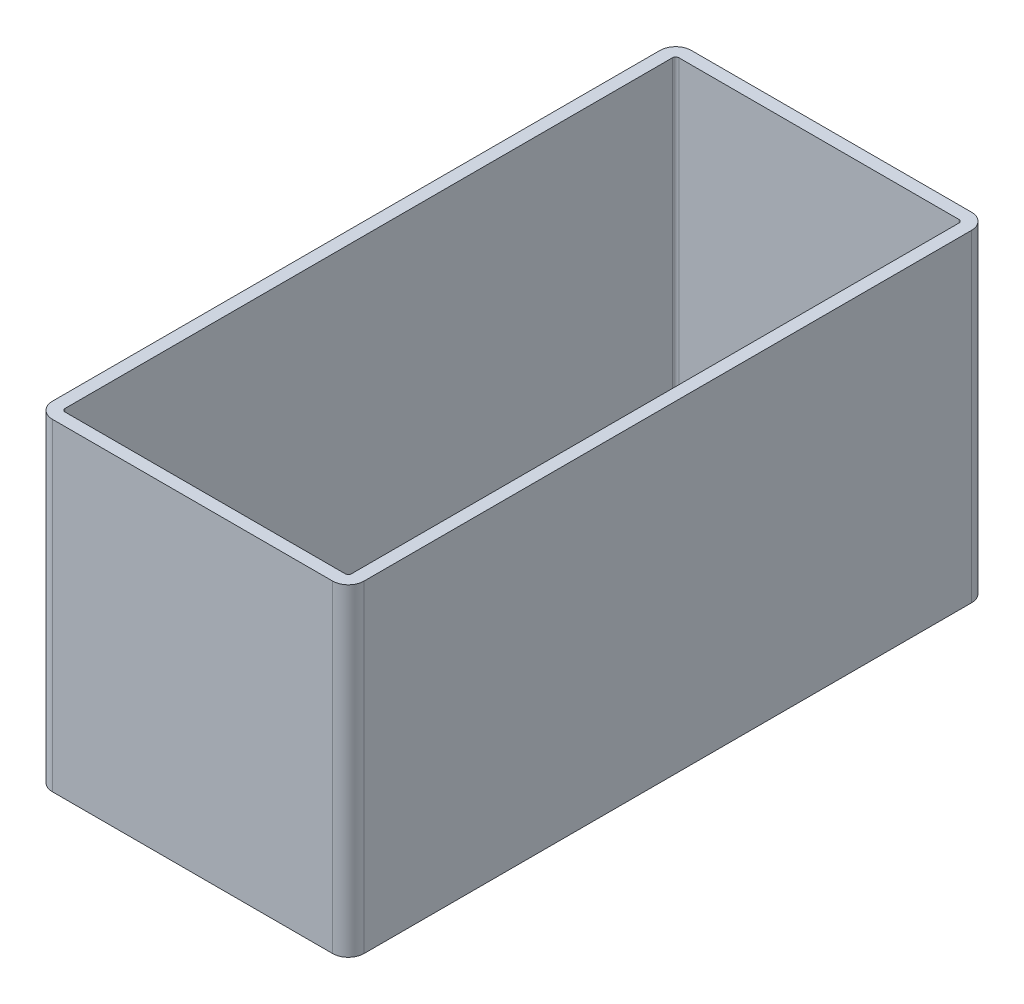
ISO-10303-21;
HEADER;
FILE_DESCRIPTION(('STEP AP214'),'2;1');
FILE_NAME('part.step','',(''),(''),'','','');
FILE_SCHEMA(('AUTOMOTIVE_DESIGN { 1 0 10303 214 1 1 1 1 }'));
ENDSEC;
DATA;
#1=APPLICATION_CONTEXT('core data for automotive mechanical design processes');
#2=APPLICATION_PROTOCOL_DEFINITION('international standard','automotive_design',2000,#1);
#3=PRODUCT_CONTEXT('',#1,'mechanical');
#4=PRODUCT('Part','Part','',(#3));
#5=PRODUCT_RELATED_PRODUCT_CATEGORY('part','',(#4));
#6=PRODUCT_DEFINITION_FORMATION('','',#4);
#7=PRODUCT_DEFINITION_CONTEXT('part definition',#1,'design');
#8=PRODUCT_DEFINITION('design','',#6,#7);
#9=PRODUCT_DEFINITION_SHAPE('','',#8);
#10=(LENGTH_UNIT() NAMED_UNIT(*) SI_UNIT(.MILLI.,.METRE.));
#11=(NAMED_UNIT(*) PLANE_ANGLE_UNIT() SI_UNIT($,.RADIAN.));
#12=(NAMED_UNIT(*) SI_UNIT($,.STERADIAN.) SOLID_ANGLE_UNIT());
#13=UNCERTAINTY_MEASURE_WITH_UNIT(LENGTH_MEASURE(1.E-05),#10,'distance_accuracy_value','');
#14=(GEOMETRIC_REPRESENTATION_CONTEXT(3) GLOBAL_UNCERTAINTY_ASSIGNED_CONTEXT((#13)) GLOBAL_UNIT_ASSIGNED_CONTEXT((#10,
#11,#12)) REPRESENTATION_CONTEXT('',''));
#15=CARTESIAN_POINT('',(0.,0.,0.));
#16=DIRECTION('',(0.,0.,1.));
#17=DIRECTION('',(1.,0.,0.));
#18=AXIS2_PLACEMENT_3D('',#15,#16,#17);
#19=CARTESIAN_POINT('',(9.9,10.25,-20.3));
#20=DIRECTION('',(-1.,0.,0.));
#21=DIRECTION('',(0.,0.,1.));
#22=AXIS2_PLACEMENT_3D('',#19,#20,#21);
#23=PLANE('',#22);
#24=DIRECTION('',(0.,0.,-1.));
#25=VECTOR('',#24,1.);
#26=CARTESIAN_POINT('',(9.9,-10.25,-20.3));
#27=LINE('',#26,#25);
#28=CARTESIAN_POINT('',(9.9,-10.25,19.3));
#29=VERTEX_POINT('',#28);
#30=CARTESIAN_POINT('',(9.9,-10.25,-19.3));
#31=VERTEX_POINT('',#30);
#32=EDGE_CURVE('E202',#29,#31,#27,.T.);
#33=ORIENTED_EDGE('',*,*,#32,.T.);
#34=DIRECTION('',(0.,-1.,0.));
#35=VECTOR('',#34,1.);
#36=CARTESIAN_POINT('',(9.9,10.25,-19.3));
#37=LINE('',#36,#35);
#38=CARTESIAN_POINT('',(9.9,10.25,-19.3));
#39=VERTEX_POINT('',#38);
#40=EDGE_CURVE('E266',#31,#39,#37,.F.);
#41=ORIENTED_EDGE('',*,*,#40,.T.);
#42=DIRECTION('',(0.,0.,-1.));
#43=VECTOR('',#42,1.);
#44=CARTESIAN_POINT('',(9.9,10.25,-20.3));
#45=LINE('',#44,#43);
#46=CARTESIAN_POINT('',(9.9,10.25,19.3));
#47=VERTEX_POINT('',#46);
#48=EDGE_CURVE('E214',#47,#39,#45,.T.);
#49=ORIENTED_EDGE('',*,*,#48,.F.);
#50=DIRECTION('',(0.,-1.,0.));
#51=VECTOR('',#50,1.);
#52=CARTESIAN_POINT('',(9.9,10.25,19.3));
#53=LINE('',#52,#51);
#54=EDGE_CURVE('E263',#47,#29,#53,.T.);
#55=ORIENTED_EDGE('',*,*,#54,.T.);
#56=EDGE_LOOP('',(#33,#41,#49,#55));
#57=FACE_BOUND('',#56,.T.);
#58=ADVANCED_FACE('F33',(#57),#23,.F.);
#59=CARTESIAN_POINT('',(-9.9,10.25,-20.3));
#60=DIRECTION('',(0.,0.,1.));
#61=DIRECTION('',(1.,0.,0.));
#62=AXIS2_PLACEMENT_3D('',#59,#60,#61);
#63=PLANE('',#62);
#64=DIRECTION('',(-1.,0.,0.));
#65=VECTOR('',#64,1.);
#66=CARTESIAN_POINT('',(-9.9,-10.25,-20.3));
#67=LINE('',#66,#65);
#68=CARTESIAN_POINT('',(8.89999999999999,-10.25,-20.3));
#69=VERTEX_POINT('',#68);
#70=CARTESIAN_POINT('',(-8.9,-10.25,-20.3));
#71=VERTEX_POINT('',#70);
#72=EDGE_CURVE('E230',#69,#71,#67,.T.);
#73=ORIENTED_EDGE('',*,*,#72,.T.);
#74=DIRECTION('',(0.,-1.,0.));
#75=VECTOR('',#74,1.);
#76=CARTESIAN_POINT('',(-8.9,10.25,-20.3));
#77=LINE('',#76,#75);
#78=CARTESIAN_POINT('',(-8.9,10.25,-20.3));
#79=VERTEX_POINT('',#78);
#80=EDGE_CURVE('E253',#71,#79,#77,.F.);
#81=ORIENTED_EDGE('',*,*,#80,.T.);
#82=DIRECTION('',(-1.,0.,0.));
#83=VECTOR('',#82,1.);
#84=CARTESIAN_POINT('',(-9.9,10.25,-20.3));
#85=LINE('',#84,#83);
#86=CARTESIAN_POINT('',(8.89999999999999,10.25,-20.3));
#87=VERTEX_POINT('',#86);
#88=EDGE_CURVE('E217',#87,#79,#85,.T.);
#89=ORIENTED_EDGE('',*,*,#88,.F.);
#90=DIRECTION('',(0.,-1.,0.));
#91=VECTOR('',#90,1.);
#92=CARTESIAN_POINT('',(8.9,10.25,-20.3));
#93=LINE('',#92,#91);
#94=EDGE_CURVE('E250',#87,#69,#93,.T.);
#95=ORIENTED_EDGE('',*,*,#94,.T.);
#96=EDGE_LOOP('',(#73,#81,#89,#95));
#97=FACE_BOUND('',#96,.T.);
#98=ADVANCED_FACE('F294',(#97),#63,.F.);
#99=CARTESIAN_POINT('',(-9.9,10.25,-20.3));
#100=DIRECTION('',(1.,0.,0.));
#101=DIRECTION('',(0.,0.,-1.));
#102=AXIS2_PLACEMENT_3D('',#99,#100,#101);
#103=PLANE('',#102);
#104=DIRECTION('',(0.,0.,1.));
#105=VECTOR('',#104,1.);
#106=CARTESIAN_POINT('',(-9.9,10.25,-20.3));
#107=LINE('',#106,#105);
#108=CARTESIAN_POINT('',(-9.9,10.25,-19.3));
#109=VERTEX_POINT('',#108);
#110=CARTESIAN_POINT('',(-9.9,10.25,19.3));
#111=VERTEX_POINT('',#110);
#112=EDGE_CURVE('E221',#109,#111,#107,.T.);
#113=ORIENTED_EDGE('',*,*,#112,.F.);
#114=DIRECTION('',(0.,-1.,0.));
#115=VECTOR('',#114,1.);
#116=CARTESIAN_POINT('',(-9.9,10.25,-19.3));
#117=LINE('',#116,#115);
#118=CARTESIAN_POINT('',(-9.9,-10.25,-19.3));
#119=VERTEX_POINT('',#118);
#120=EDGE_CURVE('E239',#109,#119,#117,.T.);
#121=ORIENTED_EDGE('',*,*,#120,.T.);
#122=DIRECTION('',(0.,0.,1.));
#123=VECTOR('',#122,1.);
#124=CARTESIAN_POINT('',(-9.9,-10.25,-20.3));
#125=LINE('',#124,#123);
#126=CARTESIAN_POINT('',(-9.9,-10.25,19.3));
#127=VERTEX_POINT('',#126);
#128=EDGE_CURVE('E233',#119,#127,#125,.T.);
#129=ORIENTED_EDGE('',*,*,#128,.T.);
#130=DIRECTION('',(0.,-1.,0.));
#131=VECTOR('',#130,1.);
#132=CARTESIAN_POINT('',(-9.9,10.25,19.3));
#133=LINE('',#132,#131);
#134=EDGE_CURVE('E227',#127,#111,#133,.F.);
#135=ORIENTED_EDGE('',*,*,#134,.T.);
#136=EDGE_LOOP('',(#113,#121,#129,#135));
#137=FACE_BOUND('',#136,.T.);
#138=ADVANCED_FACE('F302',(#137),#103,.F.);
#139=CARTESIAN_POINT('',(-9.9,10.25,20.3));
#140=DIRECTION('',(0.,0.,-1.));
#141=DIRECTION('',(-1.,0.,0.));
#142=AXIS2_PLACEMENT_3D('',#139,#140,#141);
#143=PLANE('',#142);
#144=DIRECTION('',(1.,0.,0.));
#145=VECTOR('',#144,1.);
#146=CARTESIAN_POINT('',(-9.9,-10.25,20.3));
#147=LINE('',#146,#145);
#148=CARTESIAN_POINT('',(-8.9,-10.25,20.3));
#149=VERTEX_POINT('',#148);
#150=CARTESIAN_POINT('',(8.9,-10.25,20.3));
#151=VERTEX_POINT('',#150);
#152=EDGE_CURVE('E218',#149,#151,#147,.T.);
#153=ORIENTED_EDGE('',*,*,#152,.T.);
#154=DIRECTION('',(0.,-1.,0.));
#155=VECTOR('',#154,1.);
#156=CARTESIAN_POINT('',(8.9,10.25,20.3));
#157=LINE('',#156,#155);
#158=CARTESIAN_POINT('',(8.9,10.25,20.3));
#159=VERTEX_POINT('',#158);
#160=EDGE_CURVE('E11',#151,#159,#157,.F.);
#161=ORIENTED_EDGE('',*,*,#160,.T.);
#162=DIRECTION('',(1.,0.,0.));
#163=VECTOR('',#162,1.);
#164=CARTESIAN_POINT('',(-9.9,10.25,20.3));
#165=LINE('',#164,#163);
#166=CARTESIAN_POINT('',(-8.9,10.25,20.3));
#167=VERTEX_POINT('',#166);
#168=EDGE_CURVE('E224',#167,#159,#165,.T.);
#169=ORIENTED_EDGE('',*,*,#168,.F.);
#170=DIRECTION('',(0.,-1.,0.));
#171=VECTOR('',#170,1.);
#172=CARTESIAN_POINT('',(-8.9,10.25,20.3));
#173=LINE('',#172,#171);
#174=EDGE_CURVE('E41',#167,#149,#173,.T.);
#175=ORIENTED_EDGE('',*,*,#174,.T.);
#176=EDGE_LOOP('',(#153,#161,#169,#175));
#177=FACE_BOUND('',#176,.T.);
#178=ADVANCED_FACE('F272',(#177),#143,.F.);
#179=CARTESIAN_POINT('',(0.,10.25,0.));
#180=DIRECTION('',(0.,1.,0.));
#181=DIRECTION('',(0.,0.,1.));
#182=AXIS2_PLACEMENT_3D('',#179,#180,#181);
#183=PLANE('',#182);
#184=CARTESIAN_POINT('',(8.9,10.25,-19.3));
#185=DIRECTION('',(0.,1.,0.));
#186=DIRECTION('',(0.,0.,1.));
#187=AXIS2_PLACEMENT_3D('',#184,#185,#186);
#188=CIRCLE('',#187,0.200000000000003);
#189=CARTESIAN_POINT('',(9.1,10.25,-19.3));
#190=VERTEX_POINT('',#189);
#191=CARTESIAN_POINT('',(8.89999999999999,10.25,-19.5));
#192=VERTEX_POINT('',#191);
#193=EDGE_CURVE('E48',#190,#192,#188,.T.);
#194=ORIENTED_EDGE('',*,*,#193,.F.);
#195=DIRECTION('',(0.,0.,-1.));
#196=VECTOR('',#195,1.);
#197=CARTESIAN_POINT('',(9.1,10.25,19.3));
#198=LINE('',#197,#196);
#199=CARTESIAN_POINT('',(9.1,10.25,19.3));
#200=VERTEX_POINT('',#199);
#201=EDGE_CURVE('E164',#200,#190,#198,.T.);
#202=ORIENTED_EDGE('',*,*,#201,.F.);
#203=CARTESIAN_POINT('',(8.9,10.25,19.3));
#204=DIRECTION('',(0.,1.,0.));
#205=DIRECTION('',(0.,0.,1.));
#206=AXIS2_PLACEMENT_3D('',#203,#204,#205);
#207=CIRCLE('',#206,0.200000000000001);
#208=CARTESIAN_POINT('',(8.9,10.25,19.5));
#209=VERTEX_POINT('',#208);
#210=EDGE_CURVE('E167',#209,#200,#207,.T.);
#211=ORIENTED_EDGE('',*,*,#210,.F.);
#212=DIRECTION('',(1.,0.,0.));
#213=VECTOR('',#212,1.);
#214=CARTESIAN_POINT('',(-8.9,10.25,19.5));
#215=LINE('',#214,#213);
#216=CARTESIAN_POINT('',(-8.9,10.25,19.5));
#217=VERTEX_POINT('',#216);
#218=EDGE_CURVE('E195',#217,#209,#215,.T.);
#219=ORIENTED_EDGE('',*,*,#218,.F.);
#220=CARTESIAN_POINT('',(-8.9,10.25,19.3));
#221=DIRECTION('',(0.,1.,0.));
#222=DIRECTION('',(0.,0.,1.));
#223=AXIS2_PLACEMENT_3D('',#220,#221,#222);
#224=CIRCLE('',#223,0.200000000000005);
#225=CARTESIAN_POINT('',(-9.1,10.25,19.3));
#226=VERTEX_POINT('',#225);
#227=EDGE_CURVE('E192',#226,#217,#224,.T.);
#228=ORIENTED_EDGE('',*,*,#227,.F.);
#229=DIRECTION('',(0.,0.,1.));
#230=VECTOR('',#229,1.);
#231=CARTESIAN_POINT('',(-9.1,10.25,-19.3));
#232=LINE('',#231,#230);
#233=CARTESIAN_POINT('',(-9.1,10.25,-19.3));
#234=VERTEX_POINT('',#233);
#235=EDGE_CURVE('E189',#234,#226,#232,.T.);
#236=ORIENTED_EDGE('',*,*,#235,.F.);
#237=CARTESIAN_POINT('',(-8.9,10.25,-19.3));
#238=DIRECTION('',(0.,1.,0.));
#239=DIRECTION('',(0.,0.,1.));
#240=AXIS2_PLACEMENT_3D('',#237,#238,#239);
#241=CIRCLE('',#240,0.200000000000001);
#242=CARTESIAN_POINT('',(-8.9,10.25,-19.5));
#243=VERTEX_POINT('',#242);
#244=EDGE_CURVE('E186',#243,#234,#241,.T.);
#245=ORIENTED_EDGE('',*,*,#244,.F.);
#246=DIRECTION('',(-1.,0.,0.));
#247=VECTOR('',#246,1.);
#248=CARTESIAN_POINT('',(8.89999999999999,10.25,-19.5));
#249=LINE('',#248,#247);
#250=EDGE_CURVE('E184',#192,#243,#249,.T.);
#251=ORIENTED_EDGE('',*,*,#250,.F.);
#252=EDGE_LOOP('',(#194,#202,#211,#219,#228,#236,#245,#251));
#253=FACE_BOUND('',#252,.T.);
#254=ORIENTED_EDGE('',*,*,#88,.T.);
#255=CARTESIAN_POINT('',(-8.9,10.25,-19.3));
#256=DIRECTION('',(0.,1.,0.));
#257=DIRECTION('',(0.,0.,1.));
#258=AXIS2_PLACEMENT_3D('',#255,#256,#257);
#259=CIRCLE('',#258,1.);
#260=EDGE_CURVE('E261',#79,#109,#259,.T.);
#261=ORIENTED_EDGE('',*,*,#260,.T.);
#262=ORIENTED_EDGE('',*,*,#112,.T.);
#263=CARTESIAN_POINT('',(-8.9,10.25,19.3));
#264=DIRECTION('',(0.,1.,0.));
#265=DIRECTION('',(0.,0.,1.));
#266=AXIS2_PLACEMENT_3D('',#263,#264,#265);
#267=CIRCLE('',#266,1.);
#268=EDGE_CURVE('E255',#111,#167,#267,.T.);
#269=ORIENTED_EDGE('',*,*,#268,.T.);
#270=ORIENTED_EDGE('',*,*,#168,.T.);
#271=CARTESIAN_POINT('',(8.9,10.25,19.3));
#272=DIRECTION('',(0.,1.,0.));
#273=DIRECTION('',(0.,0.,1.));
#274=AXIS2_PLACEMENT_3D('',#271,#272,#273);
#275=CIRCLE('',#274,1.);
#276=EDGE_CURVE('E257',#159,#47,#275,.T.);
#277=ORIENTED_EDGE('',*,*,#276,.T.);
#278=ORIENTED_EDGE('',*,*,#48,.T.);
#279=CARTESIAN_POINT('',(8.9,10.25,-19.3));
#280=DIRECTION('',(0.,1.,0.));
#281=DIRECTION('',(0.,0.,1.));
#282=AXIS2_PLACEMENT_3D('',#279,#280,#281);
#283=CIRCLE('',#282,1.);
#284=EDGE_CURVE('E259',#39,#87,#283,.T.);
#285=ORIENTED_EDGE('',*,*,#284,.T.);
#286=EDGE_LOOP('',(#254,#261,#262,#269,#270,#277,#278,#285));
#287=FACE_BOUND('',#286,.T.);
#288=ADVANCED_FACE('F287',(#253,#287),#183,.T.);
#289=CARTESIAN_POINT('',(0.,-10.25,0.));
#290=DIRECTION('',(0.,1.,0.));
#291=DIRECTION('',(0.,0.,1.));
#292=AXIS2_PLACEMENT_3D('',#289,#290,#291);
#293=PLANE('',#292);
#294=DIRECTION('',(0.,0.,-1.));
#295=VECTOR('',#294,1.);
#296=CARTESIAN_POINT('',(9.1,-10.25,19.3));
#297=LINE('',#296,#295);
#298=CARTESIAN_POINT('',(9.1,-10.25,19.3));
#299=VERTEX_POINT('',#298);
#300=CARTESIAN_POINT('',(9.1,-10.25,-19.3));
#301=VERTEX_POINT('',#300);
#302=EDGE_CURVE('E153',#299,#301,#297,.T.);
#303=ORIENTED_EDGE('',*,*,#302,.T.);
#304=CARTESIAN_POINT('',(8.9,-10.25,-19.3));
#305=DIRECTION('',(0.,1.,0.));
#306=DIRECTION('',(0.,0.,1.));
#307=AXIS2_PLACEMENT_3D('',#304,#305,#306);
#308=CIRCLE('',#307,0.200000000000003);
#309=CARTESIAN_POINT('',(8.89999999999999,-10.25,-19.5));
#310=VERTEX_POINT('',#309);
#311=EDGE_CURVE('E147',#301,#310,#308,.T.);
#312=ORIENTED_EDGE('',*,*,#311,.T.);
#313=DIRECTION('',(-1.,0.,0.));
#314=VECTOR('',#313,1.);
#315=CARTESIAN_POINT('',(8.89999999999999,-10.25,-19.5));
#316=LINE('',#315,#314);
#317=CARTESIAN_POINT('',(-8.9,-10.25,-19.5));
#318=VERTEX_POINT('',#317);
#319=EDGE_CURVE('E156',#310,#318,#316,.T.);
#320=ORIENTED_EDGE('',*,*,#319,.T.);
#321=CARTESIAN_POINT('',(-8.9,-10.25,-19.3));
#322=DIRECTION('',(0.,1.,0.));
#323=DIRECTION('',(0.,0.,1.));
#324=AXIS2_PLACEMENT_3D('',#321,#322,#323);
#325=CIRCLE('',#324,0.200000000000001);
#326=CARTESIAN_POINT('',(-9.1,-10.25,-19.3));
#327=VERTEX_POINT('',#326);
#328=EDGE_CURVE('E56',#318,#327,#325,.T.);
#329=ORIENTED_EDGE('',*,*,#328,.T.);
#330=DIRECTION('',(0.,0.,1.));
#331=VECTOR('',#330,1.);
#332=CARTESIAN_POINT('',(-9.1,-10.25,-19.3));
#333=LINE('',#332,#331);
#334=CARTESIAN_POINT('',(-9.1,-10.25,19.3));
#335=VERTEX_POINT('',#334);
#336=EDGE_CURVE('E171',#327,#335,#333,.T.);
#337=ORIENTED_EDGE('',*,*,#336,.T.);
#338=CARTESIAN_POINT('',(-8.9,-10.25,19.3));
#339=DIRECTION('',(0.,1.,0.));
#340=DIRECTION('',(0.,0.,1.));
#341=AXIS2_PLACEMENT_3D('',#338,#339,#340);
#342=CIRCLE('',#341,0.200000000000005);
#343=CARTESIAN_POINT('',(-8.9,-10.25,19.5));
#344=VERTEX_POINT('',#343);
#345=EDGE_CURVE('E174',#335,#344,#342,.T.);
#346=ORIENTED_EDGE('',*,*,#345,.T.);
#347=DIRECTION('',(1.,0.,0.));
#348=VECTOR('',#347,1.);
#349=CARTESIAN_POINT('',(-8.9,-10.25,19.5));
#350=LINE('',#349,#348);
#351=CARTESIAN_POINT('',(8.9,-10.25,19.5));
#352=VERTEX_POINT('',#351);
#353=EDGE_CURVE('E177',#344,#352,#350,.T.);
#354=ORIENTED_EDGE('',*,*,#353,.T.);
#355=CARTESIAN_POINT('',(8.9,-10.25,19.3));
#356=DIRECTION('',(0.,1.,0.));
#357=DIRECTION('',(0.,0.,1.));
#358=AXIS2_PLACEMENT_3D('',#355,#356,#357);
#359=CIRCLE('',#358,0.200000000000001);
#360=EDGE_CURVE('E180',#352,#299,#359,.T.);
#361=ORIENTED_EDGE('',*,*,#360,.T.);
#362=EDGE_LOOP('',(#303,#312,#320,#329,#337,#346,#354,#361));
#363=FACE_BOUND('',#362,.T.);
#364=ORIENTED_EDGE('',*,*,#128,.F.);
#365=CARTESIAN_POINT('',(-8.9,-10.25,-19.3));
#366=DIRECTION('',(0.,1.,0.));
#367=DIRECTION('',(0.,0.,1.));
#368=AXIS2_PLACEMENT_3D('',#365,#366,#367);
#369=CIRCLE('',#368,1.);
#370=EDGE_CURVE('E248',#119,#71,#369,.F.);
#371=ORIENTED_EDGE('',*,*,#370,.T.);
#372=ORIENTED_EDGE('',*,*,#72,.F.);
#373=CARTESIAN_POINT('',(8.9,-10.25,-19.3));
#374=DIRECTION('',(0.,1.,0.));
#375=DIRECTION('',(0.,0.,1.));
#376=AXIS2_PLACEMENT_3D('',#373,#374,#375);
#377=CIRCLE('',#376,1.);
#378=EDGE_CURVE('E246',#69,#31,#377,.F.);
#379=ORIENTED_EDGE('',*,*,#378,.T.);
#380=ORIENTED_EDGE('',*,*,#32,.F.);
#381=CARTESIAN_POINT('',(8.9,-10.25,19.3));
#382=DIRECTION('',(0.,1.,0.));
#383=DIRECTION('',(0.,0.,1.));
#384=AXIS2_PLACEMENT_3D('',#381,#382,#383);
#385=CIRCLE('',#384,1.);
#386=EDGE_CURVE('E244',#29,#151,#385,.F.);
#387=ORIENTED_EDGE('',*,*,#386,.T.);
#388=ORIENTED_EDGE('',*,*,#152,.F.);
#389=CARTESIAN_POINT('',(-8.9,-10.25,19.3));
#390=DIRECTION('',(0.,1.,0.));
#391=DIRECTION('',(0.,0.,1.));
#392=AXIS2_PLACEMENT_3D('',#389,#390,#391);
#393=CIRCLE('',#392,1.);
#394=EDGE_CURVE('E242',#149,#127,#393,.F.);
#395=ORIENTED_EDGE('',*,*,#394,.T.);
#396=EDGE_LOOP('',(#364,#371,#372,#379,#380,#387,#388,#395));
#397=FACE_BOUND('',#396,.T.);
#398=ADVANCED_FACE('F160',(#363,#397),#293,.F.);
#399=CARTESIAN_POINT('',(-8.9,10.25,-19.3));
#400=DIRECTION('',(0.,-1.,0.));
#401=DIRECTION('',(0.,0.,-1.));
#402=AXIS2_PLACEMENT_3D('',#399,#400,#401);
#403=CYLINDRICAL_SURFACE('',#402,1.);
#404=ORIENTED_EDGE('',*,*,#260,.F.);
#405=ORIENTED_EDGE('',*,*,#80,.F.);
#406=ORIENTED_EDGE('',*,*,#370,.F.);
#407=ORIENTED_EDGE('',*,*,#120,.F.);
#408=EDGE_LOOP('',(#404,#405,#406,#407));
#409=FACE_BOUND('',#408,.T.);
#410=ADVANCED_FACE('F299',(#409),#403,.T.);
#411=CARTESIAN_POINT('',(8.9,10.25,-19.3));
#412=DIRECTION('',(0.,-1.,0.));
#413=DIRECTION('',(0.,0.,-1.));
#414=AXIS2_PLACEMENT_3D('',#411,#412,#413);
#415=CYLINDRICAL_SURFACE('',#414,1.);
#416=ORIENTED_EDGE('',*,*,#284,.F.);
#417=ORIENTED_EDGE('',*,*,#40,.F.);
#418=ORIENTED_EDGE('',*,*,#378,.F.);
#419=ORIENTED_EDGE('',*,*,#94,.F.);
#420=EDGE_LOOP('',(#416,#417,#418,#419));
#421=FACE_BOUND('',#420,.T.);
#422=ADVANCED_FACE('F291',(#421),#415,.T.);
#423=CARTESIAN_POINT('',(8.9,10.25,19.3));
#424=DIRECTION('',(0.,-1.,0.));
#425=DIRECTION('',(0.,0.,-1.));
#426=AXIS2_PLACEMENT_3D('',#423,#424,#425);
#427=CYLINDRICAL_SURFACE('',#426,1.);
#428=ORIENTED_EDGE('',*,*,#276,.F.);
#429=ORIENTED_EDGE('',*,*,#160,.F.);
#430=ORIENTED_EDGE('',*,*,#386,.F.);
#431=ORIENTED_EDGE('',*,*,#54,.F.);
#432=EDGE_LOOP('',(#428,#429,#430,#431));
#433=FACE_BOUND('',#432,.T.);
#434=ADVANCED_FACE('F281',(#433),#427,.T.);
#435=CARTESIAN_POINT('',(-8.9,10.25,19.3));
#436=DIRECTION('',(0.,-1.,0.));
#437=DIRECTION('',(0.,0.,-1.));
#438=AXIS2_PLACEMENT_3D('',#435,#436,#437);
#439=CYLINDRICAL_SURFACE('',#438,1.);
#440=ORIENTED_EDGE('',*,*,#268,.F.);
#441=ORIENTED_EDGE('',*,*,#134,.F.);
#442=ORIENTED_EDGE('',*,*,#394,.F.);
#443=ORIENTED_EDGE('',*,*,#174,.F.);
#444=EDGE_LOOP('',(#440,#441,#442,#443));
#445=FACE_BOUND('',#444,.T.);
#446=ADVANCED_FACE('F35',(#445),#439,.T.);
#447=CARTESIAN_POINT('',(8.9,-10.25,-19.3));
#448=DIRECTION('',(0.,1.,0.));
#449=DIRECTION('',(0.,0.,1.));
#450=AXIS2_PLACEMENT_3D('',#447,#448,#449);
#451=CYLINDRICAL_SURFACE('',#450,0.200000000000003);
#452=ORIENTED_EDGE('',*,*,#193,.T.);
#453=DIRECTION('',(0.,1.,0.));
#454=VECTOR('',#453,1.);
#455=CARTESIAN_POINT('',(8.89999999999999,-10.25,-19.5));
#456=LINE('',#455,#454);
#457=EDGE_CURVE('E143',#310,#192,#456,.T.);
#458=ORIENTED_EDGE('',*,*,#457,.F.);
#459=ORIENTED_EDGE('',*,*,#311,.F.);
#460=DIRECTION('',(0.,1.,0.));
#461=VECTOR('',#460,1.);
#462=CARTESIAN_POINT('',(9.1,-10.25,-19.3));
#463=LINE('',#462,#461);
#464=EDGE_CURVE('E200',#301,#190,#463,.T.);
#465=ORIENTED_EDGE('',*,*,#464,.T.);
#466=EDGE_LOOP('',(#452,#458,#459,#465));
#467=FACE_BOUND('',#466,.T.);
#468=ADVANCED_FACE('F145',(#467),#451,.F.);
#469=CARTESIAN_POINT('',(9.1,-10.25,19.3));
#470=DIRECTION('',(1.,0.,0.));
#471=DIRECTION('',(0.,0.,-1.));
#472=AXIS2_PLACEMENT_3D('',#469,#470,#471);
#473=PLANE('',#472);
#474=ORIENTED_EDGE('',*,*,#201,.T.);
#475=ORIENTED_EDGE('',*,*,#464,.F.);
#476=ORIENTED_EDGE('',*,*,#302,.F.);
#477=DIRECTION('',(0.,1.,0.));
#478=VECTOR('',#477,1.);
#479=CARTESIAN_POINT('',(9.1,-10.25,19.3));
#480=LINE('',#479,#478);
#481=EDGE_CURVE('E203',#299,#200,#480,.T.);
#482=ORIENTED_EDGE('',*,*,#481,.T.);
#483=EDGE_LOOP('',(#474,#475,#476,#482));
#484=FACE_BOUND('',#483,.T.);
#485=ADVANCED_FACE('F309',(#484),#473,.F.);
#486=CARTESIAN_POINT('',(8.9,-10.25,19.3));
#487=DIRECTION('',(0.,1.,0.));
#488=DIRECTION('',(0.,0.,1.));
#489=AXIS2_PLACEMENT_3D('',#486,#487,#488);
#490=CYLINDRICAL_SURFACE('',#489,0.200000000000001);
#491=ORIENTED_EDGE('',*,*,#210,.T.);
#492=ORIENTED_EDGE('',*,*,#481,.F.);
#493=ORIENTED_EDGE('',*,*,#360,.F.);
#494=DIRECTION('',(0.,1.,0.));
#495=VECTOR('',#494,1.);
#496=CARTESIAN_POINT('',(8.9,-10.25,19.5));
#497=LINE('',#496,#495);
#498=EDGE_CURVE('E205',#352,#209,#497,.T.);
#499=ORIENTED_EDGE('',*,*,#498,.T.);
#500=EDGE_LOOP('',(#491,#492,#493,#499));
#501=FACE_BOUND('',#500,.T.);
#502=ADVANCED_FACE('F363',(#501),#490,.F.);
#503=CARTESIAN_POINT('',(-8.9,-10.25,19.5));
#504=DIRECTION('',(0.,0.,1.));
#505=DIRECTION('',(1.,0.,0.));
#506=AXIS2_PLACEMENT_3D('',#503,#504,#505);
#507=PLANE('',#506);
#508=ORIENTED_EDGE('',*,*,#218,.T.);
#509=ORIENTED_EDGE('',*,*,#498,.F.);
#510=ORIENTED_EDGE('',*,*,#353,.F.);
#511=DIRECTION('',(0.,1.,0.));
#512=VECTOR('',#511,1.);
#513=CARTESIAN_POINT('',(-8.9,-10.25,19.5));
#514=LINE('',#513,#512);
#515=EDGE_CURVE('E207',#344,#217,#514,.T.);
#516=ORIENTED_EDGE('',*,*,#515,.T.);
#517=EDGE_LOOP('',(#508,#509,#510,#516));
#518=FACE_BOUND('',#517,.T.);
#519=ADVANCED_FACE('F373',(#518),#507,.F.);
#520=CARTESIAN_POINT('',(-8.9,-10.25,19.3));
#521=DIRECTION('',(0.,1.,0.));
#522=DIRECTION('',(0.,0.,1.));
#523=AXIS2_PLACEMENT_3D('',#520,#521,#522);
#524=CYLINDRICAL_SURFACE('',#523,0.200000000000005);
#525=ORIENTED_EDGE('',*,*,#227,.T.);
#526=ORIENTED_EDGE('',*,*,#515,.F.);
#527=ORIENTED_EDGE('',*,*,#345,.F.);
#528=DIRECTION('',(0.,1.,0.));
#529=VECTOR('',#528,1.);
#530=CARTESIAN_POINT('',(-9.1,-10.25,19.3));
#531=LINE('',#530,#529);
#532=EDGE_CURVE('E209',#335,#226,#531,.T.);
#533=ORIENTED_EDGE('',*,*,#532,.T.);
#534=EDGE_LOOP('',(#525,#526,#527,#533));
#535=FACE_BOUND('',#534,.T.);
#536=ADVANCED_FACE('F383',(#535),#524,.F.);
#537=CARTESIAN_POINT('',(-9.1,-10.25,-19.3));
#538=DIRECTION('',(-1.,0.,0.));
#539=DIRECTION('',(0.,0.,1.));
#540=AXIS2_PLACEMENT_3D('',#537,#538,#539);
#541=PLANE('',#540);
#542=ORIENTED_EDGE('',*,*,#235,.T.);
#543=ORIENTED_EDGE('',*,*,#532,.F.);
#544=ORIENTED_EDGE('',*,*,#336,.F.);
#545=DIRECTION('',(0.,1.,0.));
#546=VECTOR('',#545,1.);
#547=CARTESIAN_POINT('',(-9.1,-10.25,-19.3));
#548=LINE('',#547,#546);
#549=EDGE_CURVE('E211',#327,#234,#548,.T.);
#550=ORIENTED_EDGE('',*,*,#549,.T.);
#551=EDGE_LOOP('',(#542,#543,#544,#550));
#552=FACE_BOUND('',#551,.T.);
#553=ADVANCED_FACE('F393',(#552),#541,.F.);
#554=CARTESIAN_POINT('',(-8.9,-10.25,-19.3));
#555=DIRECTION('',(0.,1.,0.));
#556=DIRECTION('',(0.,0.,1.));
#557=AXIS2_PLACEMENT_3D('',#554,#555,#556);
#558=CYLINDRICAL_SURFACE('',#557,0.200000000000001);
#559=ORIENTED_EDGE('',*,*,#244,.T.);
#560=ORIENTED_EDGE('',*,*,#549,.F.);
#561=ORIENTED_EDGE('',*,*,#328,.F.);
#562=DIRECTION('',(0.,1.,0.));
#563=VECTOR('',#562,1.);
#564=CARTESIAN_POINT('',(-8.9,-10.25,-19.5));
#565=LINE('',#564,#563);
#566=EDGE_CURVE('E152',#318,#243,#565,.T.);
#567=ORIENTED_EDGE('',*,*,#566,.T.);
#568=EDGE_LOOP('',(#559,#560,#561,#567));
#569=FACE_BOUND('',#568,.T.);
#570=ADVANCED_FACE('F403',(#569),#558,.F.);
#571=CARTESIAN_POINT('',(8.89999999999999,-10.25,-19.5));
#572=DIRECTION('',(0.,0.,-1.));
#573=DIRECTION('',(-1.,0.,0.));
#574=AXIS2_PLACEMENT_3D('',#571,#572,#573);
#575=PLANE('',#574);
#576=ORIENTED_EDGE('',*,*,#250,.T.);
#577=ORIENTED_EDGE('',*,*,#566,.F.);
#578=ORIENTED_EDGE('',*,*,#319,.F.);
#579=ORIENTED_EDGE('',*,*,#457,.T.);
#580=EDGE_LOOP('',(#576,#577,#578,#579));
#581=FACE_BOUND('',#580,.T.);
#582=ADVANCED_FACE('F157',(#581),#575,.F.);
#583=CLOSED_SHELL('',(#58,#98,#138,#178,#288,#398,#410,#422,#434,#446,#468,#485,#502,#519,#536,
#553,#570,#582));
#584=MANIFOLD_SOLID_BREP('B2',#583);
#585=ADVANCED_BREP_SHAPE_REPRESENTATION('',(#18,#584),#14);
#586=SHAPE_DEFINITION_REPRESENTATION(#9,#585);
ENDSEC;
END-ISO-10303-21;
